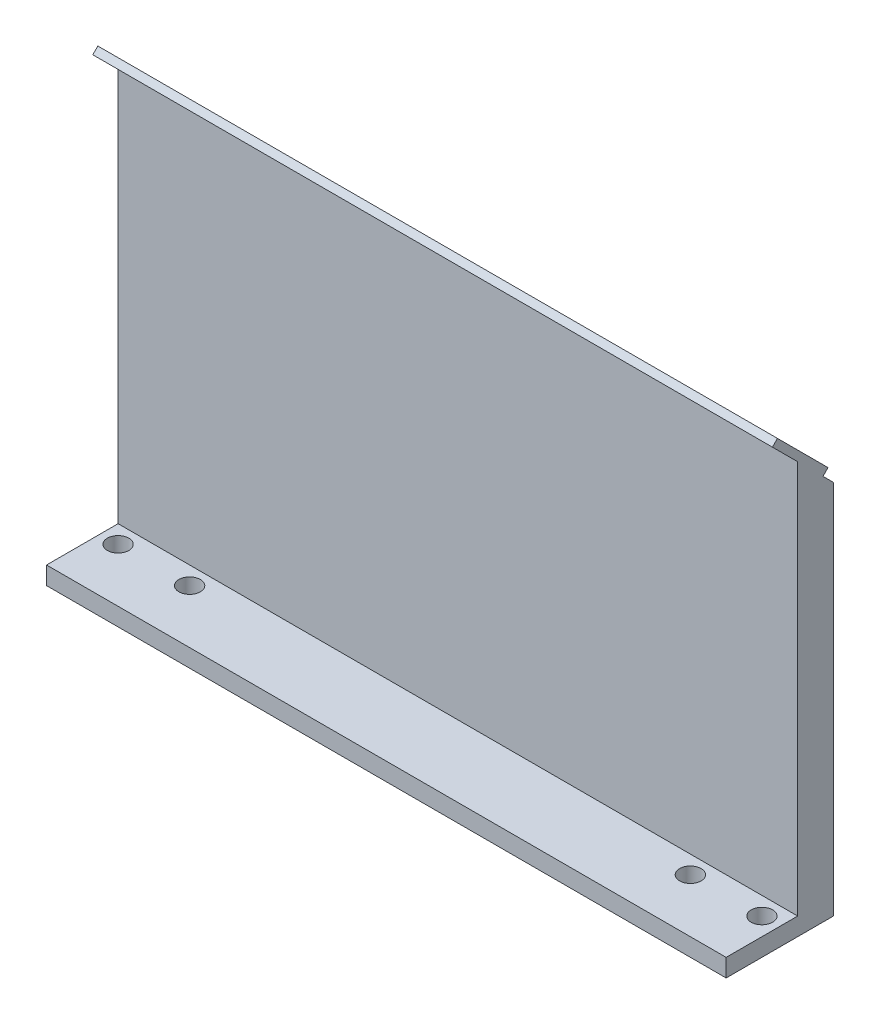
ISO-10303-21;
HEADER;
FILE_DESCRIPTION(('STEP AP214'),'2;1');
FILE_NAME('part.step','',(''),(''),'','','');
FILE_SCHEMA(('AUTOMOTIVE_DESIGN { 1 0 10303 214 1 1 1 1 }'));
ENDSEC;
DATA;
#1=APPLICATION_CONTEXT('core data for automotive mechanical design processes');
#2=APPLICATION_PROTOCOL_DEFINITION('international standard','automotive_design',2000,#1);
#3=PRODUCT_CONTEXT('',#1,'mechanical');
#4=PRODUCT('Part','Part','',(#3));
#5=PRODUCT_RELATED_PRODUCT_CATEGORY('part','',(#4));
#6=PRODUCT_DEFINITION_FORMATION('','',#4);
#7=PRODUCT_DEFINITION_CONTEXT('part definition',#1,'design');
#8=PRODUCT_DEFINITION('design','',#6,#7);
#9=PRODUCT_DEFINITION_SHAPE('','',#8);
#10=(LENGTH_UNIT() NAMED_UNIT(*) SI_UNIT(.MILLI.,.METRE.));
#11=(NAMED_UNIT(*) PLANE_ANGLE_UNIT() SI_UNIT($,.RADIAN.));
#12=(NAMED_UNIT(*) SI_UNIT($,.STERADIAN.) SOLID_ANGLE_UNIT());
#13=UNCERTAINTY_MEASURE_WITH_UNIT(LENGTH_MEASURE(1.E-05),#10,'distance_accuracy_value','');
#14=(GEOMETRIC_REPRESENTATION_CONTEXT(3) GLOBAL_UNCERTAINTY_ASSIGNED_CONTEXT((#13)) GLOBAL_UNIT_ASSIGNED_CONTEXT((#10,
#11,#12)) REPRESENTATION_CONTEXT('',''));
#15=CARTESIAN_POINT('',(0.,0.,0.));
#16=DIRECTION('',(0.,0.,1.));
#17=DIRECTION('',(1.,0.,0.));
#18=AXIS2_PLACEMENT_3D('',#15,#16,#17);
#19=CARTESIAN_POINT('',(-95.8438848920863,6.35,-31.978417266187));
#20=DIRECTION('',(1.,0.,0.));
#21=DIRECTION('',(0.,0.,-1.));
#22=AXIS2_PLACEMENT_3D('',#19,#20,#21);
#23=PLANE('',#22);
#24=DIRECTION('',(0.,-1.,0.));
#25=VECTOR('',#24,1.);
#26=CARTESIAN_POINT('',(-95.8438848920863,146.05,-19.278417266187));
#27=LINE('',#26,#25);
#28=CARTESIAN_POINT('',(-95.8438848920863,146.05,-19.2784172661871));
#29=VERTEX_POINT('',#28);
#30=CARTESIAN_POINT('',(-95.8438848920863,6.35,-19.2784172661871));
#31=VERTEX_POINT('',#30);
#32=EDGE_CURVE('E165',#29,#31,#27,.T.);
#33=ORIENTED_EDGE('',*,*,#32,.F.);
#34=DIRECTION('',(0.,0.707106781186548,0.707106781186547));
#35=VECTOR('',#34,1.);
#36=CARTESIAN_POINT('',(-95.8438848920863,137.069743878931,-28.2586733872562));
#37=LINE('',#36,#35);
#38=CARTESIAN_POINT('',(-95.8438848920863,155.030256121069,-10.2981611451179));
#39=VERTEX_POINT('',#38);
#40=EDGE_CURVE('E262',#29,#39,#37,.T.);
#41=ORIENTED_EDGE('',*,*,#40,.T.);
#42=DIRECTION('',(0.,0.70710678118655,-0.707106781186545));
#43=VECTOR('',#42,1.);
#44=CARTESIAN_POINT('',(-95.8438848920863,156.826307345283,-12.0942123693317));
#45=LINE('',#44,#43);
#46=CARTESIAN_POINT('',(-95.8438848920863,156.826307345283,-12.0942123693317));
#47=VERTEX_POINT('',#46);
#48=EDGE_CURVE('E295',#39,#47,#45,.T.);
#49=ORIENTED_EDGE('',*,*,#48,.T.);
#50=DIRECTION('',(0.,-0.707106781186547,-0.707106781186548));
#51=VECTOR('',#50,1.);
#52=CARTESIAN_POINT('',(-95.8438848920863,138.865795103145,-30.05472461147));
#53=LINE('',#52,#51);
#54=CARTESIAN_POINT('',(-95.8438848920863,138.865795103145,-30.05472461147));
#55=VERTEX_POINT('',#54);
#56=EDGE_CURVE('E257',#47,#55,#53,.T.);
#57=ORIENTED_EDGE('',*,*,#56,.T.);
#58=DIRECTION('',(0.,-0.707106781186554,0.707106781186541));
#59=VECTOR('',#58,1.);
#60=CARTESIAN_POINT('',(-95.8438848920863,138.865795103145,-30.05472461147));
#61=LINE('',#60,#59);
#62=CARTESIAN_POINT('',(-95.8438848920863,137.069743878931,-28.2586733872562));
#63=VERTEX_POINT('',#62);
#64=EDGE_CURVE('E250',#55,#63,#61,.T.);
#65=ORIENTED_EDGE('',*,*,#64,.T.);
#66=DIRECTION('',(0.,0.707106781186552,0.707106781186544));
#67=VECTOR('',#66,1.);
#68=CARTESIAN_POINT('',(-95.8438848920863,82.6642086330927,-82.6642086330937));
#69=LINE('',#68,#67);
#70=CARTESIAN_POINT('',(-95.8438848920863,133.35,-31.978417266187));
#71=VERTEX_POINT('',#70);
#72=EDGE_CURVE('E119',#71,#63,#69,.T.);
#73=ORIENTED_EDGE('',*,*,#72,.F.);
#74=DIRECTION('',(0.,-1.,0.));
#75=VECTOR('',#74,1.);
#76=CARTESIAN_POINT('',(-95.8438848920863,6.35,-31.978417266187));
#77=LINE('',#76,#75);
#78=CARTESIAN_POINT('',(-95.8438848920863,0.,-31.978417266187));
#79=VERTEX_POINT('',#78);
#80=EDGE_CURVE('E110',#71,#79,#77,.T.);
#81=ORIENTED_EDGE('',*,*,#80,.T.);
#82=DIRECTION('',(0.,0.,1.));
#83=VECTOR('',#82,1.);
#84=CARTESIAN_POINT('',(-95.8438848920863,0.,-31.978417266187));
#85=LINE('',#84,#83);
#86=CARTESIAN_POINT('',(-95.8438848920863,0.,6.12158273381296));
#87=VERTEX_POINT('',#86);
#88=EDGE_CURVE('E115',#79,#87,#85,.T.);
#89=ORIENTED_EDGE('',*,*,#88,.T.);
#90=DIRECTION('',(0.,-1.,0.));
#91=VECTOR('',#90,1.);
#92=CARTESIAN_POINT('',(-95.8438848920863,6.35,6.12158273381296));
#93=LINE('',#92,#91);
#94=CARTESIAN_POINT('',(-95.8438848920863,6.35,6.12158273381296));
#95=VERTEX_POINT('',#94);
#96=EDGE_CURVE('E12',#95,#87,#93,.T.);
#97=ORIENTED_EDGE('',*,*,#96,.F.);
#98=DIRECTION('',(0.,0.,1.));
#99=VECTOR('',#98,1.);
#100=CARTESIAN_POINT('',(-95.8438848920863,6.35,-31.978417266187));
#101=LINE('',#100,#99);
#102=EDGE_CURVE('E134',#31,#95,#101,.T.);
#103=ORIENTED_EDGE('',*,*,#102,.F.);
#104=EDGE_LOOP('',(#33,#41,#49,#57,#65,#73,#81,#89,#97,#103));
#105=FACE_BOUND('',#104,.T.);
#106=ADVANCED_FACE('F69',(#105),#23,.F.);
#107=CARTESIAN_POINT('',(-95.8438848920863,6.35,6.12158273381296));
#108=DIRECTION('',(0.,0.,-1.));
#109=DIRECTION('',(-1.,0.,0.));
#110=AXIS2_PLACEMENT_3D('',#107,#108,#109);
#111=PLANE('',#110);
#112=DIRECTION('',(1.,0.,0.));
#113=VECTOR('',#112,1.);
#114=CARTESIAN_POINT('',(-95.8438848920863,0.,6.12158273381296));
#115=LINE('',#114,#113);
#116=CARTESIAN_POINT('',(145.456115107914,0.,6.12158273381296));
#117=VERTEX_POINT('',#116);
#118=EDGE_CURVE('E138',#87,#117,#115,.T.);
#119=ORIENTED_EDGE('',*,*,#118,.T.);
#120=DIRECTION('',(0.,-1.,0.));
#121=VECTOR('',#120,1.);
#122=CARTESIAN_POINT('',(145.456115107914,6.35,6.12158273381296));
#123=LINE('',#122,#121);
#124=CARTESIAN_POINT('',(145.456115107914,6.35,6.12158273381296));
#125=VERTEX_POINT('',#124);
#126=EDGE_CURVE('E77',#125,#117,#123,.T.);
#127=ORIENTED_EDGE('',*,*,#126,.F.);
#128=DIRECTION('',(1.,0.,0.));
#129=VECTOR('',#128,1.);
#130=CARTESIAN_POINT('',(-95.8438848920863,6.35,6.12158273381296));
#131=LINE('',#130,#129);
#132=EDGE_CURVE('E90',#95,#125,#131,.T.);
#133=ORIENTED_EDGE('',*,*,#132,.F.);
#134=ORIENTED_EDGE('',*,*,#96,.T.);
#135=EDGE_LOOP('',(#119,#127,#133,#134));
#136=FACE_BOUND('',#135,.T.);
#137=ADVANCED_FACE('F161',(#136),#111,.F.);
#138=CARTESIAN_POINT('',(145.456115107914,6.35,-31.978417266187));
#139=DIRECTION('',(-1.,0.,0.));
#140=DIRECTION('',(0.,0.,1.));
#141=AXIS2_PLACEMENT_3D('',#138,#139,#140);
#142=PLANE('',#141);
#143=DIRECTION('',(0.,-1.,0.));
#144=VECTOR('',#143,1.);
#145=CARTESIAN_POINT('',(145.456115107914,6.35,-31.978417266187));
#146=LINE('',#145,#144);
#147=CARTESIAN_POINT('',(145.456115107914,133.35,-31.978417266187));
#148=VERTEX_POINT('',#147);
#149=CARTESIAN_POINT('',(145.456115107914,0.,-31.978417266187));
#150=VERTEX_POINT('',#149);
#151=EDGE_CURVE('E123',#148,#150,#146,.T.);
#152=ORIENTED_EDGE('',*,*,#151,.F.);
#153=DIRECTION('',(0.,0.707106781186552,0.707106781186544));
#154=VECTOR('',#153,1.);
#155=CARTESIAN_POINT('',(145.456115107914,82.6642086330927,-82.6642086330937));
#156=LINE('',#155,#154);
#157=CARTESIAN_POINT('',(145.456115107914,137.069743878931,-28.2586733872562));
#158=VERTEX_POINT('',#157);
#159=EDGE_CURVE('E267',#148,#158,#156,.T.);
#160=ORIENTED_EDGE('',*,*,#159,.T.);
#161=DIRECTION('',(0.,0.707106781186554,-0.707106781186541));
#162=VECTOR('',#161,1.);
#163=CARTESIAN_POINT('',(145.456115107914,138.865795103145,-30.05472461147));
#164=LINE('',#163,#162);
#165=CARTESIAN_POINT('',(145.456115107914,138.865795103145,-30.05472461147));
#166=VERTEX_POINT('',#165);
#167=EDGE_CURVE('E252',#158,#166,#164,.T.);
#168=ORIENTED_EDGE('',*,*,#167,.T.);
#169=DIRECTION('',(0.,0.707106781186547,0.707106781186548));
#170=VECTOR('',#169,1.);
#171=CARTESIAN_POINT('',(145.456115107914,138.865795103145,-30.05472461147));
#172=LINE('',#171,#170);
#173=CARTESIAN_POINT('',(145.456115107914,156.826307345283,-12.0942123693317));
#174=VERTEX_POINT('',#173);
#175=EDGE_CURVE('E287',#166,#174,#172,.T.);
#176=ORIENTED_EDGE('',*,*,#175,.T.);
#177=DIRECTION('',(0.,-0.70710678118655,0.707106781186545));
#178=VECTOR('',#177,1.);
#179=CARTESIAN_POINT('',(145.456115107914,156.826307345283,-12.0942123693317));
#180=LINE('',#179,#178);
#181=CARTESIAN_POINT('',(145.456115107914,155.030256121069,-10.2981611451179));
#182=VERTEX_POINT('',#181);
#183=EDGE_CURVE('E284',#174,#182,#180,.T.);
#184=ORIENTED_EDGE('',*,*,#183,.T.);
#185=DIRECTION('',(0.,-0.707106781186548,-0.707106781186547));
#186=VECTOR('',#185,1.);
#187=CARTESIAN_POINT('',(145.456115107914,137.069743878931,-28.2586733872562));
#188=LINE('',#187,#186);
#189=CARTESIAN_POINT('',(145.456115107914,146.05,-19.278417266187));
#190=VERTEX_POINT('',#189);
#191=EDGE_CURVE('E268',#182,#190,#188,.T.);
#192=ORIENTED_EDGE('',*,*,#191,.T.);
#193=DIRECTION('',(0.,-1.,0.));
#194=VECTOR('',#193,1.);
#195=CARTESIAN_POINT('',(145.456115107914,146.05,-19.278417266187));
#196=LINE('',#195,#194);
#197=CARTESIAN_POINT('',(145.456115107914,6.35,-19.278417266187));
#198=VERTEX_POINT('',#197);
#199=EDGE_CURVE('E176',#190,#198,#196,.T.);
#200=ORIENTED_EDGE('',*,*,#199,.T.);
#201=DIRECTION('',(0.,0.,-1.));
#202=VECTOR('',#201,1.);
#203=CARTESIAN_POINT('',(145.456115107914,6.35,-31.978417266187));
#204=LINE('',#203,#202);
#205=EDGE_CURVE('E124',#125,#198,#204,.T.);
#206=ORIENTED_EDGE('',*,*,#205,.F.);
#207=ORIENTED_EDGE('',*,*,#126,.T.);
#208=DIRECTION('',(0.,0.,-1.));
#209=VECTOR('',#208,1.);
#210=CARTESIAN_POINT('',(145.456115107914,0.,-31.978417266187));
#211=LINE('',#210,#209);
#212=EDGE_CURVE('E135',#117,#150,#211,.T.);
#213=ORIENTED_EDGE('',*,*,#212,.T.);
#214=EDGE_LOOP('',(#152,#160,#168,#176,#184,#192,#200,#206,#207,#213));
#215=FACE_BOUND('',#214,.T.);
#216=ADVANCED_FACE('F158',(#215),#142,.F.);
#217=CARTESIAN_POINT('',(-95.8438848920863,6.35,-31.978417266187));
#218=DIRECTION('',(0.,0.,1.));
#219=DIRECTION('',(1.,0.,0.));
#220=AXIS2_PLACEMENT_3D('',#217,#218,#219);
#221=PLANE('',#220);
#222=ORIENTED_EDGE('',*,*,#80,.F.);
#223=DIRECTION('',(-1.,0.,0.));
#224=VECTOR('',#223,1.);
#225=CARTESIAN_POINT('',(145.456115107914,133.35,-31.978417266187));
#226=LINE('',#225,#224);
#227=EDGE_CURVE('E265',#148,#71,#226,.T.);
#228=ORIENTED_EDGE('',*,*,#227,.F.);
#229=ORIENTED_EDGE('',*,*,#151,.T.);
#230=DIRECTION('',(-1.,0.,0.));
#231=VECTOR('',#230,1.);
#232=CARTESIAN_POINT('',(-95.8438848920863,0.,-31.978417266187));
#233=LINE('',#232,#231);
#234=EDGE_CURVE('E127',#150,#79,#233,.T.);
#235=ORIENTED_EDGE('',*,*,#234,.T.);
#236=EDGE_LOOP('',(#222,#228,#229,#235));
#237=FACE_BOUND('',#236,.T.);
#238=ADVANCED_FACE('F128',(#237),#221,.F.);
#239=CARTESIAN_POINT('',(0.,6.35,0.));
#240=DIRECTION('',(0.,1.,0.));
#241=DIRECTION('',(0.,0.,1.));
#242=AXIS2_PLACEMENT_3D('',#239,#240,#241);
#243=PLANE('',#242);
#244=DIRECTION('',(1.,0.,0.));
#245=VECTOR('',#244,1.);
#246=CARTESIAN_POINT('',(-95.8438848920863,6.35,-19.278417266187));
#247=LINE('',#246,#245);
#248=EDGE_CURVE('E84',#31,#198,#247,.T.);
#249=ORIENTED_EDGE('',*,*,#248,.F.);
#250=ORIENTED_EDGE('',*,*,#102,.T.);
#251=ORIENTED_EDGE('',*,*,#132,.T.);
#252=ORIENTED_EDGE('',*,*,#205,.T.);
#253=EDGE_LOOP('',(#249,#250,#251,#252));
#254=FACE_BOUND('',#253,.T.);
#255=CARTESIAN_POINT('',(-89.4938848920863,6.35,-12.928417266187));
#256=DIRECTION('',(0.,1.,0.));
#257=DIRECTION('',(0.,0.,1.));
#258=AXIS2_PLACEMENT_3D('',#255,#256,#257);
#259=CIRCLE('',#258,3.81);
#260=CARTESIAN_POINT('',(-89.4938848920863,6.35,-9.11841726618704));
#261=VERTEX_POINT('',#260);
#262=EDGE_CURVE('E146',#261,#261,#259,.T.);
#263=ORIENTED_EDGE('',*,*,#262,.F.);
#264=EDGE_LOOP('',(#263));
#265=FACE_BOUND('',#264,.T.);
#266=CARTESIAN_POINT('',(113.706115107914,6.35,-12.928417266187));
#267=DIRECTION('',(0.,1.,0.));
#268=DIRECTION('',(0.,0.,1.));
#269=AXIS2_PLACEMENT_3D('',#266,#267,#268);
#270=CIRCLE('',#269,3.81);
#271=CARTESIAN_POINT('',(113.706115107914,6.35,-9.11841726618704));
#272=VERTEX_POINT('',#271);
#273=EDGE_CURVE('E181',#272,#272,#270,.T.);
#274=ORIENTED_EDGE('',*,*,#273,.F.);
#275=EDGE_LOOP('',(#274));
#276=FACE_BOUND('',#275,.T.);
#277=CARTESIAN_POINT('',(139.106115107914,6.35,-12.928417266187));
#278=DIRECTION('',(0.,1.,0.));
#279=DIRECTION('',(0.,0.,1.));
#280=AXIS2_PLACEMENT_3D('',#277,#278,#279);
#281=CIRCLE('',#280,3.81000000000001);
#282=CARTESIAN_POINT('',(139.106115107914,6.35,-9.11841726618703));
#283=VERTEX_POINT('',#282);
#284=EDGE_CURVE('E201',#283,#283,#281,.T.);
#285=ORIENTED_EDGE('',*,*,#284,.F.);
#286=EDGE_LOOP('',(#285));
#287=FACE_BOUND('',#286,.T.);
#288=CARTESIAN_POINT('',(-64.0938848920864,6.35,-12.928417266187));
#289=DIRECTION('',(0.,1.,0.));
#290=DIRECTION('',(0.,0.,1.));
#291=AXIS2_PLACEMENT_3D('',#288,#289,#290);
#292=CIRCLE('',#291,3.81);
#293=CARTESIAN_POINT('',(-64.0938848920864,6.35,-9.11841726618704));
#294=VERTEX_POINT('',#293);
#295=EDGE_CURVE('E189',#294,#294,#292,.T.);
#296=ORIENTED_EDGE('',*,*,#295,.F.);
#297=EDGE_LOOP('',(#296));
#298=FACE_BOUND('',#297,.T.);
#299=ADVANCED_FACE('F209',(#254,#265,#276,#287,#298),#243,.T.);
#300=CARTESIAN_POINT('',(0.,0.,0.));
#301=DIRECTION('',(0.,1.,0.));
#302=DIRECTION('',(0.,0.,1.));
#303=AXIS2_PLACEMENT_3D('',#300,#301,#302);
#304=PLANE('',#303);
#305=CARTESIAN_POINT('',(-89.4938848920863,0.,-12.928417266187));
#306=DIRECTION('',(0.,1.,0.));
#307=DIRECTION('',(0.,0.,1.));
#308=AXIS2_PLACEMENT_3D('',#305,#306,#307);
#309=CIRCLE('',#308,3.81);
#310=CARTESIAN_POINT('',(-89.4938848920863,0.,-9.11841726618704));
#311=VERTEX_POINT('',#310);
#312=EDGE_CURVE('E140',#311,#311,#309,.T.);
#313=ORIENTED_EDGE('',*,*,#312,.T.);
#314=EDGE_LOOP('',(#313));
#315=FACE_BOUND('',#314,.T.);
#316=CARTESIAN_POINT('',(113.706115107914,0.,-12.928417266187));
#317=DIRECTION('',(0.,1.,0.));
#318=DIRECTION('',(0.,0.,1.));
#319=AXIS2_PLACEMENT_3D('',#316,#317,#318);
#320=CIRCLE('',#319,3.81);
#321=CARTESIAN_POINT('',(113.706115107914,0.,-9.11841726618704));
#322=VERTEX_POINT('',#321);
#323=EDGE_CURVE('E175',#322,#322,#320,.T.);
#324=ORIENTED_EDGE('',*,*,#323,.T.);
#325=EDGE_LOOP('',(#324));
#326=FACE_BOUND('',#325,.T.);
#327=CARTESIAN_POINT('',(139.106115107914,0.,-12.928417266187));
#328=DIRECTION('',(0.,1.,0.));
#329=DIRECTION('',(0.,0.,1.));
#330=AXIS2_PLACEMENT_3D('',#327,#328,#329);
#331=CIRCLE('',#330,3.81000000000001);
#332=CARTESIAN_POINT('',(139.106115107914,0.,-9.11841726618703));
#333=VERTEX_POINT('',#332);
#334=EDGE_CURVE('E192',#333,#333,#331,.T.);
#335=ORIENTED_EDGE('',*,*,#334,.T.);
#336=EDGE_LOOP('',(#335));
#337=FACE_BOUND('',#336,.T.);
#338=CARTESIAN_POINT('',(-64.0938848920864,0.,-12.928417266187));
#339=DIRECTION('',(0.,1.,0.));
#340=DIRECTION('',(0.,0.,1.));
#341=AXIS2_PLACEMENT_3D('',#338,#339,#340);
#342=CIRCLE('',#341,3.81);
#343=CARTESIAN_POINT('',(-64.0938848920864,0.,-9.11841726618704));
#344=VERTEX_POINT('',#343);
#345=EDGE_CURVE('E197',#344,#344,#342,.T.);
#346=ORIENTED_EDGE('',*,*,#345,.T.);
#347=EDGE_LOOP('',(#346));
#348=FACE_BOUND('',#347,.T.);
#349=ORIENTED_EDGE('',*,*,#88,.F.);
#350=ORIENTED_EDGE('',*,*,#234,.F.);
#351=ORIENTED_EDGE('',*,*,#212,.F.);
#352=ORIENTED_EDGE('',*,*,#118,.F.);
#353=EDGE_LOOP('',(#349,#350,#351,#352));
#354=FACE_BOUND('',#353,.T.);
#355=ADVANCED_FACE('F137',(#315,#326,#337,#348,#354),#304,.F.);
#356=CARTESIAN_POINT('',(-64.0938848920864,0.,-12.928417266187));
#357=DIRECTION('',(0.,1.,0.));
#358=DIRECTION('',(0.,0.,1.));
#359=AXIS2_PLACEMENT_3D('',#356,#357,#358);
#360=CYLINDRICAL_SURFACE('',#359,3.81);
#361=ORIENTED_EDGE('',*,*,#345,.F.);
#362=EDGE_LOOP('',(#361));
#363=FACE_BOUND('',#362,.T.);
#364=ORIENTED_EDGE('',*,*,#295,.T.);
#365=EDGE_LOOP('',(#364));
#366=FACE_BOUND('',#365,.T.);
#367=ADVANCED_FACE('F336',(#363,#366),#360,.F.);
#368=CARTESIAN_POINT('',(139.106115107914,0.,-12.928417266187));
#369=DIRECTION('',(0.,1.,0.));
#370=DIRECTION('',(0.,0.,1.));
#371=AXIS2_PLACEMENT_3D('',#368,#369,#370);
#372=CYLINDRICAL_SURFACE('',#371,3.81000000000001);
#373=ORIENTED_EDGE('',*,*,#334,.F.);
#374=EDGE_LOOP('',(#373));
#375=FACE_BOUND('',#374,.T.);
#376=ORIENTED_EDGE('',*,*,#284,.T.);
#377=EDGE_LOOP('',(#376));
#378=FACE_BOUND('',#377,.T.);
#379=ADVANCED_FACE('F340',(#375,#378),#372,.F.);
#380=CARTESIAN_POINT('',(113.706115107914,0.,-12.928417266187));
#381=DIRECTION('',(0.,1.,0.));
#382=DIRECTION('',(0.,0.,1.));
#383=AXIS2_PLACEMENT_3D('',#380,#381,#382);
#384=CYLINDRICAL_SURFACE('',#383,3.81);
#385=ORIENTED_EDGE('',*,*,#323,.F.);
#386=EDGE_LOOP('',(#385));
#387=FACE_BOUND('',#386,.T.);
#388=ORIENTED_EDGE('',*,*,#273,.T.);
#389=EDGE_LOOP('',(#388));
#390=FACE_BOUND('',#389,.T.);
#391=ADVANCED_FACE('F343',(#387,#390),#384,.F.);
#392=CARTESIAN_POINT('',(-89.4938848920863,0.,-12.928417266187));
#393=DIRECTION('',(0.,1.,0.));
#394=DIRECTION('',(0.,0.,1.));
#395=AXIS2_PLACEMENT_3D('',#392,#393,#394);
#396=CYLINDRICAL_SURFACE('',#395,3.81);
#397=ORIENTED_EDGE('',*,*,#312,.F.);
#398=EDGE_LOOP('',(#397));
#399=FACE_BOUND('',#398,.T.);
#400=ORIENTED_EDGE('',*,*,#262,.T.);
#401=EDGE_LOOP('',(#400));
#402=FACE_BOUND('',#401,.T.);
#403=ADVANCED_FACE('F350',(#399,#402),#396,.F.);
#404=CARTESIAN_POINT('',(-95.8438848920863,146.05,-19.278417266187));
#405=DIRECTION('',(0.,0.,-1.));
#406=DIRECTION('',(-1.,0.,0.));
#407=AXIS2_PLACEMENT_3D('',#404,#405,#406);
#408=PLANE('',#407);
#409=ORIENTED_EDGE('',*,*,#248,.T.);
#410=ORIENTED_EDGE('',*,*,#199,.F.);
#411=DIRECTION('',(1.,0.,0.));
#412=VECTOR('',#411,1.);
#413=CARTESIAN_POINT('',(-95.8438848920863,146.05,-19.278417266187));
#414=LINE('',#413,#412);
#415=EDGE_CURVE('E173',#29,#190,#414,.T.);
#416=ORIENTED_EDGE('',*,*,#415,.F.);
#417=ORIENTED_EDGE('',*,*,#32,.T.);
#418=EDGE_LOOP('',(#409,#410,#416,#417));
#419=FACE_BOUND('',#418,.T.);
#420=ADVANCED_FACE('F170',(#419),#408,.F.);
#421=CARTESIAN_POINT('',(145.456115107914,82.6642086330927,-82.6642086330937));
#422=DIRECTION('',(0.,-0.707106781186544,0.707106781186552));
#423=DIRECTION('',(0.,-0.707106781186552,-0.707106781186544));
#424=AXIS2_PLACEMENT_3D('',#421,#422,#423);
#425=PLANE('',#424);
#426=ORIENTED_EDGE('',*,*,#72,.T.);
#427=DIRECTION('',(-1.,0.,0.));
#428=VECTOR('',#427,1.);
#429=CARTESIAN_POINT('',(173.396115107914,137.069743878931,-28.2586733872562));
#430=LINE('',#429,#428);
#431=EDGE_CURVE('E247',#158,#63,#430,.T.);
#432=ORIENTED_EDGE('',*,*,#431,.F.);
#433=ORIENTED_EDGE('',*,*,#159,.F.);
#434=ORIENTED_EDGE('',*,*,#227,.T.);
#435=EDGE_LOOP('',(#426,#432,#433,#434));
#436=FACE_BOUND('',#435,.T.);
#437=ADVANCED_FACE('F264',(#436),#425,.F.);
#438=CARTESIAN_POINT('',(173.396115107914,137.069743878931,-28.2586733872562));
#439=DIRECTION('',(0.,-0.707106781186547,0.707106781186548));
#440=DIRECTION('',(0.,-0.707106781186548,-0.707106781186547));
#441=AXIS2_PLACEMENT_3D('',#438,#439,#440);
#442=PLANE('',#441);
#443=ORIENTED_EDGE('',*,*,#415,.T.);
#444=ORIENTED_EDGE('',*,*,#191,.F.);
#445=DIRECTION('',(-1.,0.,0.));
#446=VECTOR('',#445,1.);
#447=CARTESIAN_POINT('',(173.396115107914,155.030256121069,-10.2981611451179));
#448=LINE('',#447,#446);
#449=EDGE_CURVE('E256',#182,#39,#448,.T.);
#450=ORIENTED_EDGE('',*,*,#449,.T.);
#451=ORIENTED_EDGE('',*,*,#40,.F.);
#452=EDGE_LOOP('',(#443,#444,#450,#451));
#453=FACE_BOUND('',#452,.T.);
#454=ADVANCED_FACE('F281',(#453),#442,.T.);
#455=CARTESIAN_POINT('',(173.396115107914,138.865795103145,-30.05472461147));
#456=DIRECTION('',(0.,-0.707106781186541,-0.707106781186554));
#457=DIRECTION('',(0.,0.707106781186554,-0.707106781186541));
#458=AXIS2_PLACEMENT_3D('',#455,#456,#457);
#459=PLANE('',#458);
#460=ORIENTED_EDGE('',*,*,#167,.F.);
#461=ORIENTED_EDGE('',*,*,#431,.T.);
#462=ORIENTED_EDGE('',*,*,#64,.F.);
#463=DIRECTION('',(-1.,0.,0.));
#464=VECTOR('',#463,1.);
#465=CARTESIAN_POINT('',(173.396115107914,138.865795103145,-30.05472461147));
#466=LINE('',#465,#464);
#467=EDGE_CURVE('E291',#166,#55,#466,.T.);
#468=ORIENTED_EDGE('',*,*,#467,.F.);
#469=EDGE_LOOP('',(#460,#461,#462,#468));
#470=FACE_BOUND('',#469,.T.);
#471=ADVANCED_FACE('F248',(#470),#459,.T.);
#472=CARTESIAN_POINT('',(173.396115107914,138.865795103145,-30.05472461147));
#473=DIRECTION('',(0.,0.707106781186548,-0.707106781186547));
#474=DIRECTION('',(0.,0.707106781186547,0.707106781186548));
#475=AXIS2_PLACEMENT_3D('',#472,#473,#474);
#476=PLANE('',#475);
#477=ORIENTED_EDGE('',*,*,#175,.F.);
#478=ORIENTED_EDGE('',*,*,#467,.T.);
#479=ORIENTED_EDGE('',*,*,#56,.F.);
#480=DIRECTION('',(-1.,0.,0.));
#481=VECTOR('',#480,1.);
#482=CARTESIAN_POINT('',(173.396115107914,156.826307345283,-12.0942123693317));
#483=LINE('',#482,#481);
#484=EDGE_CURVE('E297',#174,#47,#483,.T.);
#485=ORIENTED_EDGE('',*,*,#484,.F.);
#486=EDGE_LOOP('',(#477,#478,#479,#485));
#487=FACE_BOUND('',#486,.T.);
#488=ADVANCED_FACE('F314',(#487),#476,.T.);
#489=CARTESIAN_POINT('',(173.396115107914,156.826307345283,-12.0942123693317));
#490=DIRECTION('',(0.,0.707106781186545,0.70710678118655));
#491=DIRECTION('',(0.,-0.70710678118655,0.707106781186545));
#492=AXIS2_PLACEMENT_3D('',#489,#490,#491);
#493=PLANE('',#492);
#494=ORIENTED_EDGE('',*,*,#183,.F.);
#495=ORIENTED_EDGE('',*,*,#484,.T.);
#496=ORIENTED_EDGE('',*,*,#48,.F.);
#497=ORIENTED_EDGE('',*,*,#449,.F.);
#498=EDGE_LOOP('',(#494,#495,#496,#497));
#499=FACE_BOUND('',#498,.T.);
#500=ADVANCED_FACE('F294',(#499),#493,.T.);
#501=CLOSED_SHELL('',(#106,#137,#216,#238,#299,#355,#367,#379,#391,#403,#420,#437,#454,#471,
#488,#500));
#502=MANIFOLD_SOLID_BREP('B2',#501);
#503=ADVANCED_BREP_SHAPE_REPRESENTATION('',(#18,#502),#14);
#504=SHAPE_DEFINITION_REPRESENTATION(#9,#503);
ENDSEC;
END-ISO-10303-21;
